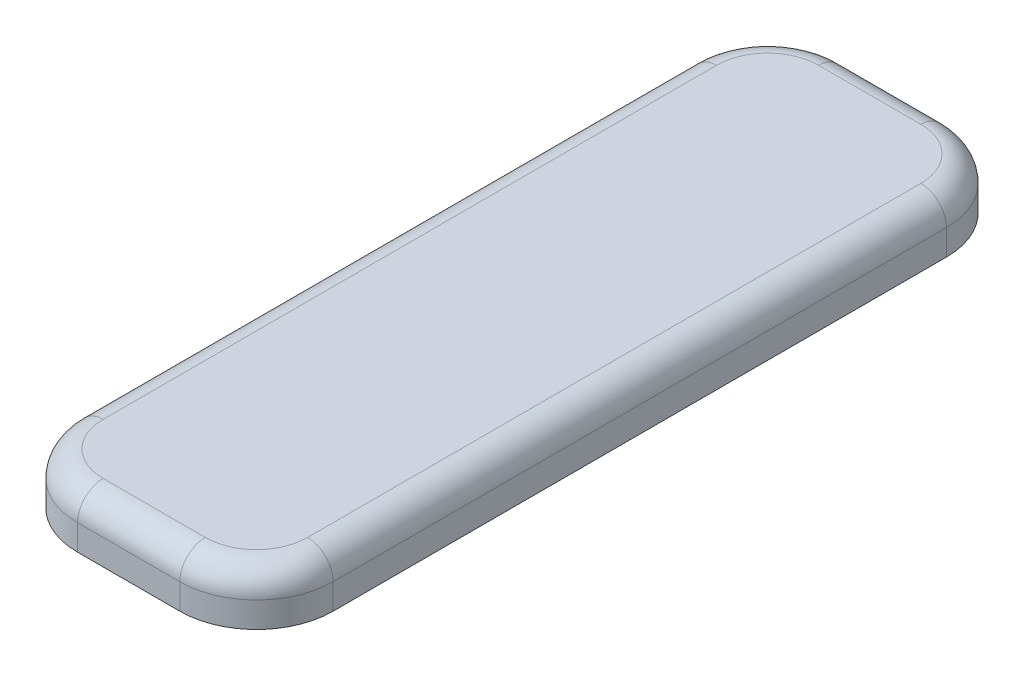
ISO-10303-21;
HEADER;
FILE_DESCRIPTION(('STEP AP214'),'2;1');
FILE_NAME('part.step','',(''),(''),'','','');
FILE_SCHEMA(('AUTOMOTIVE_DESIGN { 1 0 10303 214 1 1 1 1 }'));
ENDSEC;
DATA;
#1=APPLICATION_CONTEXT('core data for automotive mechanical design processes');
#2=APPLICATION_PROTOCOL_DEFINITION('international standard','automotive_design',2000,#1);
#3=PRODUCT_CONTEXT('',#1,'mechanical');
#4=PRODUCT('Part','Part','',(#3));
#5=PRODUCT_RELATED_PRODUCT_CATEGORY('part','',(#4));
#6=PRODUCT_DEFINITION_FORMATION('','',#4);
#7=PRODUCT_DEFINITION_CONTEXT('part definition',#1,'design');
#8=PRODUCT_DEFINITION('design','',#6,#7);
#9=PRODUCT_DEFINITION_SHAPE('','',#8);
#10=(LENGTH_UNIT() NAMED_UNIT(*) SI_UNIT(.MILLI.,.METRE.));
#11=(NAMED_UNIT(*) PLANE_ANGLE_UNIT() SI_UNIT($,.RADIAN.));
#12=(NAMED_UNIT(*) SI_UNIT($,.STERADIAN.) SOLID_ANGLE_UNIT());
#13=UNCERTAINTY_MEASURE_WITH_UNIT(LENGTH_MEASURE(1.E-05),#10,'distance_accuracy_value','');
#14=(GEOMETRIC_REPRESENTATION_CONTEXT(3) GLOBAL_UNCERTAINTY_ASSIGNED_CONTEXT((#13)) GLOBAL_UNIT_ASSIGNED_CONTEXT((#10,
#11,#12)) REPRESENTATION_CONTEXT('',''));
#15=CARTESIAN_POINT('',(0.,0.,0.));
#16=DIRECTION('',(0.,0.,1.));
#17=DIRECTION('',(1.,0.,0.));
#18=AXIS2_PLACEMENT_3D('',#15,#16,#17);
#19=CARTESIAN_POINT('',(-20.,20.,-120.));
#20=DIRECTION('',(0.,-1.,0.));
#21=DIRECTION('',(0.,0.,-1.));
#22=AXIS2_PLACEMENT_3D('',#19,#20,#21);
#23=CYLINDRICAL_SURFACE('',#22,30.);
#24=DIRECTION('',(0.,-1.,0.));
#25=VECTOR('',#24,1.);
#26=CARTESIAN_POINT('',(-50.,20.,-120.));
#27=LINE('',#26,#25);
#28=CARTESIAN_POINT('',(-50.,10.,-120.));
#29=VERTEX_POINT('',#28);
#30=CARTESIAN_POINT('',(-50.,0.,-120.));
#31=VERTEX_POINT('',#30);
#32=EDGE_CURVE('E122',#29,#31,#27,.T.);
#33=ORIENTED_EDGE('',*,*,#32,.F.);
#34=CARTESIAN_POINT('',(-20.,10.,-120.));
#35=DIRECTION('',(0.,-1.,0.));
#36=DIRECTION('',(0.,0.,-1.));
#37=AXIS2_PLACEMENT_3D('',#34,#35,#36);
#38=CIRCLE('',#37,30.);
#39=CARTESIAN_POINT('',(-19.9999999999998,10.,-150.));
#40=VERTEX_POINT('',#39);
#41=EDGE_CURVE('E11',#29,#40,#38,.T.);
#42=ORIENTED_EDGE('',*,*,#41,.T.);
#43=DIRECTION('',(0.,-1.,0.));
#44=VECTOR('',#43,1.);
#45=CARTESIAN_POINT('',(-19.9999999999998,20.,-150.));
#46=LINE('',#45,#44);
#47=CARTESIAN_POINT('',(-19.9999999999998,0.,-150.));
#48=VERTEX_POINT('',#47);
#49=EDGE_CURVE('E143',#40,#48,#46,.T.);
#50=ORIENTED_EDGE('',*,*,#49,.T.);
#51=CARTESIAN_POINT('',(-20.,0.,-120.));
#52=DIRECTION('',(0.,1.,0.));
#53=DIRECTION('',(0.,0.,-1.));
#54=AXIS2_PLACEMENT_3D('',#51,#52,#53);
#55=CIRCLE('',#54,30.);
#56=EDGE_CURVE('E137',#48,#31,#55,.T.);
#57=ORIENTED_EDGE('',*,*,#56,.T.);
#58=EDGE_LOOP('',(#33,#42,#50,#57));
#59=FACE_BOUND('',#58,.T.);
#60=ADVANCED_FACE('F34',(#59),#23,.T.);
#61=CARTESIAN_POINT('',(-50.,20.,120.));
#62=DIRECTION('',(1.,0.,0.));
#63=DIRECTION('',(0.,0.,-1.));
#64=AXIS2_PLACEMENT_3D('',#61,#62,#63);
#65=PLANE('',#64);
#66=DIRECTION('',(0.,-1.,0.));
#67=VECTOR('',#66,1.);
#68=CARTESIAN_POINT('',(-50.,20.,120.));
#69=LINE('',#68,#67);
#70=CARTESIAN_POINT('',(-50.,10.,120.));
#71=VERTEX_POINT('',#70);
#72=CARTESIAN_POINT('',(-50.,0.,120.));
#73=VERTEX_POINT('',#72);
#74=EDGE_CURVE('E131',#71,#73,#69,.T.);
#75=ORIENTED_EDGE('',*,*,#74,.F.);
#76=DIRECTION('',(0.,0.,1.));
#77=VECTOR('',#76,1.);
#78=CARTESIAN_POINT('',(-50.,10.,120.));
#79=LINE('',#78,#77);
#80=EDGE_CURVE('E43',#71,#29,#79,.F.);
#81=ORIENTED_EDGE('',*,*,#80,.T.);
#82=ORIENTED_EDGE('',*,*,#32,.T.);
#83=DIRECTION('',(0.,0.,1.));
#84=VECTOR('',#83,1.);
#85=CARTESIAN_POINT('',(-50.,0.,120.));
#86=LINE('',#85,#84);
#87=EDGE_CURVE('E125',#31,#73,#86,.T.);
#88=ORIENTED_EDGE('',*,*,#87,.T.);
#89=EDGE_LOOP('',(#75,#81,#82,#88));
#90=FACE_BOUND('',#89,.T.);
#91=ADVANCED_FACE('F124',(#90),#65,.F.);
#92=CARTESIAN_POINT('',(-20.,20.,120.));
#93=DIRECTION('',(0.,-1.,0.));
#94=DIRECTION('',(0.,0.,-1.));
#95=AXIS2_PLACEMENT_3D('',#92,#93,#94);
#96=CYLINDRICAL_SURFACE('',#95,30.);
#97=DIRECTION('',(0.,-1.,0.));
#98=VECTOR('',#97,1.);
#99=CARTESIAN_POINT('',(-19.9999999999998,20.,150.));
#100=LINE('',#99,#98);
#101=CARTESIAN_POINT('',(-19.9999999999998,10.,150.));
#102=VERTEX_POINT('',#101);
#103=CARTESIAN_POINT('',(-19.9999999999998,0.,150.));
#104=VERTEX_POINT('',#103);
#105=EDGE_CURVE('E173',#102,#104,#100,.T.);
#106=ORIENTED_EDGE('',*,*,#105,.F.);
#107=CARTESIAN_POINT('',(-20.,10.,120.));
#108=DIRECTION('',(0.,-1.,0.));
#109=DIRECTION('',(0.,0.,-1.));
#110=AXIS2_PLACEMENT_3D('',#107,#108,#109);
#111=CIRCLE('',#110,30.);
#112=EDGE_CURVE('E58',#102,#71,#111,.T.);
#113=ORIENTED_EDGE('',*,*,#112,.T.);
#114=ORIENTED_EDGE('',*,*,#74,.T.);
#115=CARTESIAN_POINT('',(-20.,0.,120.));
#116=DIRECTION('',(0.,1.,0.));
#117=DIRECTION('',(0.,0.,-1.));
#118=AXIS2_PLACEMENT_3D('',#115,#116,#117);
#119=CIRCLE('',#118,30.);
#120=EDGE_CURVE('E140',#73,#104,#119,.T.);
#121=ORIENTED_EDGE('',*,*,#120,.T.);
#122=EDGE_LOOP('',(#106,#113,#114,#121));
#123=FACE_BOUND('',#122,.T.);
#124=ADVANCED_FACE('F276',(#123),#96,.T.);
#125=CARTESIAN_POINT('',(-19.9999999999998,20.,150.));
#126=DIRECTION('',(0.,0.,-1.));
#127=DIRECTION('',(-1.,0.,0.));
#128=AXIS2_PLACEMENT_3D('',#125,#126,#127);
#129=PLANE('',#128);
#130=DIRECTION('',(0.,-1.,0.));
#131=VECTOR('',#130,1.);
#132=CARTESIAN_POINT('',(19.9999999999998,20.,150.));
#133=LINE('',#132,#131);
#134=CARTESIAN_POINT('',(19.9999999999998,10.,150.));
#135=VERTEX_POINT('',#134);
#136=CARTESIAN_POINT('',(19.9999999999998,0.,150.));
#137=VERTEX_POINT('',#136);
#138=EDGE_CURVE('E171',#135,#137,#133,.T.);
#139=ORIENTED_EDGE('',*,*,#138,.F.);
#140=DIRECTION('',(1.,0.,0.));
#141=VECTOR('',#140,1.);
#142=CARTESIAN_POINT('',(-19.9999999999998,10.,150.));
#143=LINE('',#142,#141);
#144=EDGE_CURVE('E201',#135,#102,#143,.F.);
#145=ORIENTED_EDGE('',*,*,#144,.T.);
#146=ORIENTED_EDGE('',*,*,#105,.T.);
#147=DIRECTION('',(1.,0.,0.));
#148=VECTOR('',#147,1.);
#149=CARTESIAN_POINT('',(-19.9999999999998,0.,150.));
#150=LINE('',#149,#148);
#151=EDGE_CURVE('E150',#104,#137,#150,.T.);
#152=ORIENTED_EDGE('',*,*,#151,.T.);
#153=EDGE_LOOP('',(#139,#145,#146,#152));
#154=FACE_BOUND('',#153,.T.);
#155=ADVANCED_FACE('F274',(#154),#129,.F.);
#156=CARTESIAN_POINT('',(20.,20.,120.));
#157=DIRECTION('',(0.,-1.,0.));
#158=DIRECTION('',(0.,0.,-1.));
#159=AXIS2_PLACEMENT_3D('',#156,#157,#158);
#160=CYLINDRICAL_SURFACE('',#159,30.);
#161=DIRECTION('',(0.,-1.,0.));
#162=VECTOR('',#161,1.);
#163=CARTESIAN_POINT('',(50.,20.,120.));
#164=LINE('',#163,#162);
#165=CARTESIAN_POINT('',(50.,10.,120.));
#166=VERTEX_POINT('',#165);
#167=CARTESIAN_POINT('',(50.,0.,120.));
#168=VERTEX_POINT('',#167);
#169=EDGE_CURVE('E169',#166,#168,#164,.T.);
#170=ORIENTED_EDGE('',*,*,#169,.F.);
#171=CARTESIAN_POINT('',(20.,10.,120.));
#172=DIRECTION('',(0.,-1.,0.));
#173=DIRECTION('',(0.,0.,-1.));
#174=AXIS2_PLACEMENT_3D('',#171,#172,#173);
#175=CIRCLE('',#174,30.);
#176=EDGE_CURVE('E199',#166,#135,#175,.T.);
#177=ORIENTED_EDGE('',*,*,#176,.T.);
#178=ORIENTED_EDGE('',*,*,#138,.T.);
#179=CARTESIAN_POINT('',(20.,0.,120.));
#180=DIRECTION('',(0.,1.,0.));
#181=DIRECTION('',(0.,0.,-1.));
#182=AXIS2_PLACEMENT_3D('',#179,#180,#181);
#183=CIRCLE('',#182,30.);
#184=EDGE_CURVE('E153',#137,#168,#183,.T.);
#185=ORIENTED_EDGE('',*,*,#184,.T.);
#186=EDGE_LOOP('',(#170,#177,#178,#185));
#187=FACE_BOUND('',#186,.T.);
#188=ADVANCED_FACE('F272',(#187),#160,.T.);
#189=CARTESIAN_POINT('',(50.,20.,120.));
#190=DIRECTION('',(-1.,0.,0.));
#191=DIRECTION('',(0.,0.,1.));
#192=AXIS2_PLACEMENT_3D('',#189,#190,#191);
#193=PLANE('',#192);
#194=DIRECTION('',(0.,-1.,0.));
#195=VECTOR('',#194,1.);
#196=CARTESIAN_POINT('',(50.,20.,-120.));
#197=LINE('',#196,#195);
#198=CARTESIAN_POINT('',(50.,10.,-120.));
#199=VERTEX_POINT('',#198);
#200=CARTESIAN_POINT('',(50.,0.,-120.));
#201=VERTEX_POINT('',#200);
#202=EDGE_CURVE('E167',#199,#201,#197,.T.);
#203=ORIENTED_EDGE('',*,*,#202,.F.);
#204=DIRECTION('',(0.,0.,-1.));
#205=VECTOR('',#204,1.);
#206=CARTESIAN_POINT('',(50.,10.,120.));
#207=LINE('',#206,#205);
#208=EDGE_CURVE('E197',#199,#166,#207,.F.);
#209=ORIENTED_EDGE('',*,*,#208,.T.);
#210=ORIENTED_EDGE('',*,*,#169,.T.);
#211=DIRECTION('',(0.,0.,-1.));
#212=VECTOR('',#211,1.);
#213=CARTESIAN_POINT('',(50.,0.,120.));
#214=LINE('',#213,#212);
#215=EDGE_CURVE('E156',#168,#201,#214,.T.);
#216=ORIENTED_EDGE('',*,*,#215,.T.);
#217=EDGE_LOOP('',(#203,#209,#210,#216));
#218=FACE_BOUND('',#217,.T.);
#219=ADVANCED_FACE('F260',(#218),#193,.F.);
#220=CARTESIAN_POINT('',(20.,20.,-120.));
#221=DIRECTION('',(0.,-1.,0.));
#222=DIRECTION('',(0.,0.,-1.));
#223=AXIS2_PLACEMENT_3D('',#220,#221,#222);
#224=CYLINDRICAL_SURFACE('',#223,30.);
#225=DIRECTION('',(0.,-1.,0.));
#226=VECTOR('',#225,1.);
#227=CARTESIAN_POINT('',(19.9999999999998,20.,-150.));
#228=LINE('',#227,#226);
#229=CARTESIAN_POINT('',(19.9999999999998,10.,-150.));
#230=VERTEX_POINT('',#229);
#231=CARTESIAN_POINT('',(19.9999999999998,0.,-150.));
#232=VERTEX_POINT('',#231);
#233=EDGE_CURVE('E165',#230,#232,#228,.T.);
#234=ORIENTED_EDGE('',*,*,#233,.F.);
#235=CARTESIAN_POINT('',(20.,10.,-120.));
#236=DIRECTION('',(0.,-1.,0.));
#237=DIRECTION('',(0.,0.,-1.));
#238=AXIS2_PLACEMENT_3D('',#235,#236,#237);
#239=CIRCLE('',#238,30.);
#240=EDGE_CURVE('E195',#230,#199,#239,.T.);
#241=ORIENTED_EDGE('',*,*,#240,.T.);
#242=ORIENTED_EDGE('',*,*,#202,.T.);
#243=CARTESIAN_POINT('',(20.,0.,-120.));
#244=DIRECTION('',(0.,1.,0.));
#245=DIRECTION('',(0.,0.,-1.));
#246=AXIS2_PLACEMENT_3D('',#243,#244,#245);
#247=CIRCLE('',#246,30.);
#248=EDGE_CURVE('E159',#201,#232,#247,.T.);
#249=ORIENTED_EDGE('',*,*,#248,.T.);
#250=EDGE_LOOP('',(#234,#241,#242,#249));
#251=FACE_BOUND('',#250,.T.);
#252=ADVANCED_FACE('F257',(#251),#224,.T.);
#253=CARTESIAN_POINT('',(-19.9999999999998,20.,-150.));
#254=DIRECTION('',(0.,0.,1.));
#255=DIRECTION('',(1.,0.,0.));
#256=AXIS2_PLACEMENT_3D('',#253,#254,#255);
#257=PLANE('',#256);
#258=ORIENTED_EDGE('',*,*,#49,.F.);
#259=DIRECTION('',(-1.,0.,0.));
#260=VECTOR('',#259,1.);
#261=CARTESIAN_POINT('',(-19.9999999999998,10.,-150.));
#262=LINE('',#261,#260);
#263=EDGE_CURVE('E192',#40,#230,#262,.F.);
#264=ORIENTED_EDGE('',*,*,#263,.T.);
#265=ORIENTED_EDGE('',*,*,#233,.T.);
#266=DIRECTION('',(-1.,0.,0.));
#267=VECTOR('',#266,1.);
#268=CARTESIAN_POINT('',(-19.9999999999998,0.,-150.));
#269=LINE('',#268,#267);
#270=EDGE_CURVE('E162',#232,#48,#269,.T.);
#271=ORIENTED_EDGE('',*,*,#270,.T.);
#272=EDGE_LOOP('',(#258,#264,#265,#271));
#273=FACE_BOUND('',#272,.T.);
#274=ADVANCED_FACE('F244',(#273),#257,.F.);
#275=CARTESIAN_POINT('',(-20.,20.,-120.));
#276=DIRECTION('',(0.,-1.,0.));
#277=DIRECTION('',(0.,0.,-1.));
#278=AXIS2_PLACEMENT_3D('',#275,#276,#277);
#279=PLANE('',#278);
#280=CARTESIAN_POINT('',(20.,20.,-120.));
#281=DIRECTION('',(0.,-1.,0.));
#282=DIRECTION('',(0.,0.,-1.));
#283=AXIS2_PLACEMENT_3D('',#280,#281,#282);
#284=CIRCLE('',#283,20.);
#285=CARTESIAN_POINT('',(40.,20.,-120.));
#286=VERTEX_POINT('',#285);
#287=CARTESIAN_POINT('',(19.9999999999998,20.,-140.));
#288=VERTEX_POINT('',#287);
#289=EDGE_CURVE('E187',#286,#288,#284,.F.);
#290=ORIENTED_EDGE('',*,*,#289,.T.);
#291=DIRECTION('',(-1.,0.,0.));
#292=VECTOR('',#291,1.);
#293=CARTESIAN_POINT('',(-20.,20.,-140.));
#294=LINE('',#293,#292);
#295=CARTESIAN_POINT('',(-19.9999999999998,20.,-140.));
#296=VERTEX_POINT('',#295);
#297=EDGE_CURVE('E189',#288,#296,#294,.T.);
#298=ORIENTED_EDGE('',*,*,#297,.T.);
#299=CARTESIAN_POINT('',(-20.,20.,-120.));
#300=DIRECTION('',(0.,-1.,0.));
#301=DIRECTION('',(0.,0.,-1.));
#302=AXIS2_PLACEMENT_3D('',#299,#300,#301);
#303=CIRCLE('',#302,20.);
#304=CARTESIAN_POINT('',(-40.,20.,-120.));
#305=VERTEX_POINT('',#304);
#306=EDGE_CURVE('E130',#296,#305,#303,.F.);
#307=ORIENTED_EDGE('',*,*,#306,.T.);
#308=DIRECTION('',(0.,0.,1.));
#309=VECTOR('',#308,1.);
#310=CARTESIAN_POINT('',(-40.,20.,-120.));
#311=LINE('',#310,#309);
#312=CARTESIAN_POINT('',(-40.,20.,120.));
#313=VERTEX_POINT('',#312);
#314=EDGE_CURVE('E177',#305,#313,#311,.T.);
#315=ORIENTED_EDGE('',*,*,#314,.T.);
#316=CARTESIAN_POINT('',(-20.,20.,120.));
#317=DIRECTION('',(0.,-1.,0.));
#318=DIRECTION('',(0.,0.,-1.));
#319=AXIS2_PLACEMENT_3D('',#316,#317,#318);
#320=CIRCLE('',#319,20.);
#321=CARTESIAN_POINT('',(-19.9999999999998,20.,140.));
#322=VERTEX_POINT('',#321);
#323=EDGE_CURVE('E179',#313,#322,#320,.F.);
#324=ORIENTED_EDGE('',*,*,#323,.T.);
#325=DIRECTION('',(1.,0.,0.));
#326=VECTOR('',#325,1.);
#327=CARTESIAN_POINT('',(-20.,20.,140.));
#328=LINE('',#327,#326);
#329=CARTESIAN_POINT('',(19.9999999999999,20.,140.));
#330=VERTEX_POINT('',#329);
#331=EDGE_CURVE('E181',#322,#330,#328,.T.);
#332=ORIENTED_EDGE('',*,*,#331,.T.);
#333=CARTESIAN_POINT('',(20.,20.,120.));
#334=DIRECTION('',(0.,-1.,0.));
#335=DIRECTION('',(0.,0.,-1.));
#336=AXIS2_PLACEMENT_3D('',#333,#334,#335);
#337=CIRCLE('',#336,20.);
#338=CARTESIAN_POINT('',(40.,20.,120.));
#339=VERTEX_POINT('',#338);
#340=EDGE_CURVE('E183',#330,#339,#337,.F.);
#341=ORIENTED_EDGE('',*,*,#340,.T.);
#342=DIRECTION('',(0.,0.,-1.));
#343=VECTOR('',#342,1.);
#344=CARTESIAN_POINT('',(40.,20.,-120.));
#345=LINE('',#344,#343);
#346=EDGE_CURVE('E185',#339,#286,#345,.T.);
#347=ORIENTED_EDGE('',*,*,#346,.T.);
#348=EDGE_LOOP('',(#290,#298,#307,#315,#324,#332,#341,#347));
#349=FACE_BOUND('',#348,.T.);
#350=ADVANCED_FACE('F232',(#349),#279,.F.);
#351=CARTESIAN_POINT('',(-20.,0.,-120.));
#352=DIRECTION('',(0.,-1.,0.));
#353=DIRECTION('',(0.,0.,-1.));
#354=AXIS2_PLACEMENT_3D('',#351,#352,#353);
#355=PLANE('',#354);
#356=ORIENTED_EDGE('',*,*,#56,.F.);
#357=ORIENTED_EDGE('',*,*,#270,.F.);
#358=ORIENTED_EDGE('',*,*,#248,.F.);
#359=ORIENTED_EDGE('',*,*,#215,.F.);
#360=ORIENTED_EDGE('',*,*,#184,.F.);
#361=ORIENTED_EDGE('',*,*,#151,.F.);
#362=ORIENTED_EDGE('',*,*,#120,.F.);
#363=ORIENTED_EDGE('',*,*,#87,.F.);
#364=EDGE_LOOP('',(#356,#357,#358,#359,#360,#361,#362,#363));
#365=FACE_BOUND('',#364,.T.);
#366=ADVANCED_FACE('F135',(#365),#355,.T.);
#367=CARTESIAN_POINT('',(-20.,10.,140.));
#368=DIRECTION('',(1.,0.,0.));
#369=DIRECTION('',(0.,0.,-1.));
#370=AXIS2_PLACEMENT_3D('',#367,#368,#369);
#371=CYLINDRICAL_SURFACE('',#370,10.);
#372=CARTESIAN_POINT('',(-19.9999999999998,10.,140.));
#373=DIRECTION('',(-1.,0.,0.));
#374=DIRECTION('',(0.,0.,1.));
#375=AXIS2_PLACEMENT_3D('',#372,#373,#374);
#376=CIRCLE('',#375,10.);
#377=EDGE_CURVE('E147',#102,#322,#376,.T.);
#378=ORIENTED_EDGE('',*,*,#377,.F.);
#379=ORIENTED_EDGE('',*,*,#144,.F.);
#380=CARTESIAN_POINT('',(19.9999999999999,10.,140.));
#381=DIRECTION('',(1.,0.,0.));
#382=DIRECTION('',(0.,0.,-1.));
#383=AXIS2_PLACEMENT_3D('',#380,#381,#382);
#384=CIRCLE('',#383,10.);
#385=EDGE_CURVE('E38',#330,#135,#384,.T.);
#386=ORIENTED_EDGE('',*,*,#385,.F.);
#387=ORIENTED_EDGE('',*,*,#331,.F.);
#388=EDGE_LOOP('',(#378,#379,#386,#387));
#389=FACE_BOUND('',#388,.T.);
#390=ADVANCED_FACE('F36',(#389),#371,.T.);
#391=CARTESIAN_POINT('',(20.,10.,120.));
#392=DIRECTION('',(0.,-1.,0.));
#393=DIRECTION('',(0.,0.,-1.));
#394=AXIS2_PLACEMENT_3D('',#391,#392,#393);
#395=TOROIDAL_SURFACE('',#394,20.,10.);
#396=ORIENTED_EDGE('',*,*,#385,.T.);
#397=ORIENTED_EDGE('',*,*,#176,.F.);
#398=CARTESIAN_POINT('',(40.,10.,120.));
#399=DIRECTION('',(0.,0.,-1.));
#400=DIRECTION('',(-1.,0.,0.));
#401=AXIS2_PLACEMENT_3D('',#398,#399,#400);
#402=CIRCLE('',#401,10.);
#403=EDGE_CURVE('E218',#339,#166,#402,.T.);
#404=ORIENTED_EDGE('',*,*,#403,.F.);
#405=ORIENTED_EDGE('',*,*,#340,.F.);
#406=EDGE_LOOP('',(#396,#397,#404,#405));
#407=FACE_BOUND('',#406,.T.);
#408=ADVANCED_FACE('F269',(#407),#395,.T.);
#409=CARTESIAN_POINT('',(-20.,10.,120.));
#410=DIRECTION('',(0.,-1.,0.));
#411=DIRECTION('',(0.,0.,-1.));
#412=AXIS2_PLACEMENT_3D('',#409,#410,#411);
#413=TOROIDAL_SURFACE('',#412,20.,10.);
#414=ORIENTED_EDGE('',*,*,#377,.T.);
#415=ORIENTED_EDGE('',*,*,#323,.F.);
#416=CARTESIAN_POINT('',(-40.,10.,120.));
#417=DIRECTION('',(0.,0.,-1.));
#418=DIRECTION('',(-1.,0.,0.));
#419=AXIS2_PLACEMENT_3D('',#416,#417,#418);
#420=CIRCLE('',#419,10.);
#421=EDGE_CURVE('E215',#71,#313,#420,.T.);
#422=ORIENTED_EDGE('',*,*,#421,.F.);
#423=ORIENTED_EDGE('',*,*,#112,.F.);
#424=EDGE_LOOP('',(#414,#415,#422,#423));
#425=FACE_BOUND('',#424,.T.);
#426=ADVANCED_FACE('F224',(#425),#413,.T.);
#427=CARTESIAN_POINT('',(40.,10.,-120.));
#428=DIRECTION('',(0.,0.,-1.));
#429=DIRECTION('',(-1.,0.,0.));
#430=AXIS2_PLACEMENT_3D('',#427,#428,#429);
#431=CYLINDRICAL_SURFACE('',#430,10.);
#432=ORIENTED_EDGE('',*,*,#403,.T.);
#433=ORIENTED_EDGE('',*,*,#208,.F.);
#434=CARTESIAN_POINT('',(40.,10.,-120.));
#435=DIRECTION('',(0.,0.,-1.));
#436=DIRECTION('',(-1.,0.,0.));
#437=AXIS2_PLACEMENT_3D('',#434,#435,#436);
#438=CIRCLE('',#437,10.);
#439=EDGE_CURVE('E212',#286,#199,#438,.T.);
#440=ORIENTED_EDGE('',*,*,#439,.F.);
#441=ORIENTED_EDGE('',*,*,#346,.F.);
#442=EDGE_LOOP('',(#432,#433,#440,#441));
#443=FACE_BOUND('',#442,.T.);
#444=ADVANCED_FACE('F265',(#443),#431,.T.);
#445=CARTESIAN_POINT('',(-40.,10.,-120.));
#446=DIRECTION('',(0.,0.,1.));
#447=DIRECTION('',(1.,0.,0.));
#448=AXIS2_PLACEMENT_3D('',#445,#446,#447);
#449=CYLINDRICAL_SURFACE('',#448,10.);
#450=ORIENTED_EDGE('',*,*,#421,.T.);
#451=ORIENTED_EDGE('',*,*,#314,.F.);
#452=CARTESIAN_POINT('',(-40.,10.,-120.));
#453=DIRECTION('',(0.,0.,-1.));
#454=DIRECTION('',(-1.,0.,0.));
#455=AXIS2_PLACEMENT_3D('',#452,#453,#454);
#456=CIRCLE('',#455,10.);
#457=EDGE_CURVE('E209',#29,#305,#456,.T.);
#458=ORIENTED_EDGE('',*,*,#457,.F.);
#459=ORIENTED_EDGE('',*,*,#80,.F.);
#460=EDGE_LOOP('',(#450,#451,#458,#459));
#461=FACE_BOUND('',#460,.T.);
#462=ADVANCED_FACE('F237',(#461),#449,.T.);
#463=CARTESIAN_POINT('',(20.,10.,-120.));
#464=DIRECTION('',(0.,-1.,0.));
#465=DIRECTION('',(0.,0.,-1.));
#466=AXIS2_PLACEMENT_3D('',#463,#464,#465);
#467=TOROIDAL_SURFACE('',#466,20.,10.);
#468=ORIENTED_EDGE('',*,*,#439,.T.);
#469=ORIENTED_EDGE('',*,*,#240,.F.);
#470=CARTESIAN_POINT('',(19.9999999999998,10.,-140.));
#471=DIRECTION('',(-1.,0.,0.));
#472=DIRECTION('',(0.,0.,1.));
#473=AXIS2_PLACEMENT_3D('',#470,#471,#472);
#474=CIRCLE('',#473,10.);
#475=EDGE_CURVE('E207',#288,#230,#474,.T.);
#476=ORIENTED_EDGE('',*,*,#475,.F.);
#477=ORIENTED_EDGE('',*,*,#289,.F.);
#478=EDGE_LOOP('',(#468,#469,#476,#477));
#479=FACE_BOUND('',#478,.T.);
#480=ADVANCED_FACE('F253',(#479),#467,.T.);
#481=CARTESIAN_POINT('',(-20.,10.,-120.));
#482=DIRECTION('',(0.,-1.,0.));
#483=DIRECTION('',(0.,0.,-1.));
#484=AXIS2_PLACEMENT_3D('',#481,#482,#483);
#485=TOROIDAL_SURFACE('',#484,20.,10.);
#486=ORIENTED_EDGE('',*,*,#457,.T.);
#487=ORIENTED_EDGE('',*,*,#306,.F.);
#488=CARTESIAN_POINT('',(-19.9999999999999,10.,-140.));
#489=DIRECTION('',(1.,0.,0.));
#490=DIRECTION('',(0.,1.,0.));
#491=AXIS2_PLACEMENT_3D('',#488,#489,#490);
#492=CIRCLE('',#491,10.);
#493=EDGE_CURVE('E205',#40,#296,#492,.T.);
#494=ORIENTED_EDGE('',*,*,#493,.F.);
#495=ORIENTED_EDGE('',*,*,#41,.F.);
#496=EDGE_LOOP('',(#486,#487,#494,#495));
#497=FACE_BOUND('',#496,.T.);
#498=ADVANCED_FACE('F240',(#497),#485,.T.);
#499=CARTESIAN_POINT('',(-20.,10.,-140.));
#500=DIRECTION('',(-1.,0.,0.));
#501=DIRECTION('',(0.,0.,1.));
#502=AXIS2_PLACEMENT_3D('',#499,#500,#501);
#503=CYLINDRICAL_SURFACE('',#502,10.);
#504=ORIENTED_EDGE('',*,*,#475,.T.);
#505=ORIENTED_EDGE('',*,*,#263,.F.);
#506=ORIENTED_EDGE('',*,*,#493,.T.);
#507=ORIENTED_EDGE('',*,*,#297,.F.);
#508=EDGE_LOOP('',(#504,#505,#506,#507));
#509=FACE_BOUND('',#508,.T.);
#510=ADVANCED_FACE('F247',(#509),#503,.T.);
#511=CLOSED_SHELL('',(#60,#91,#124,#155,#188,#219,#252,#274,#350,#366,#390,#408,#426,#444,#462,
#480,#498,#510));
#512=MANIFOLD_SOLID_BREP('B2',#511);
#513=ADVANCED_BREP_SHAPE_REPRESENTATION('',(#18,#512),#14);
#514=SHAPE_DEFINITION_REPRESENTATION(#9,#513);
ENDSEC;
END-ISO-10303-21;
